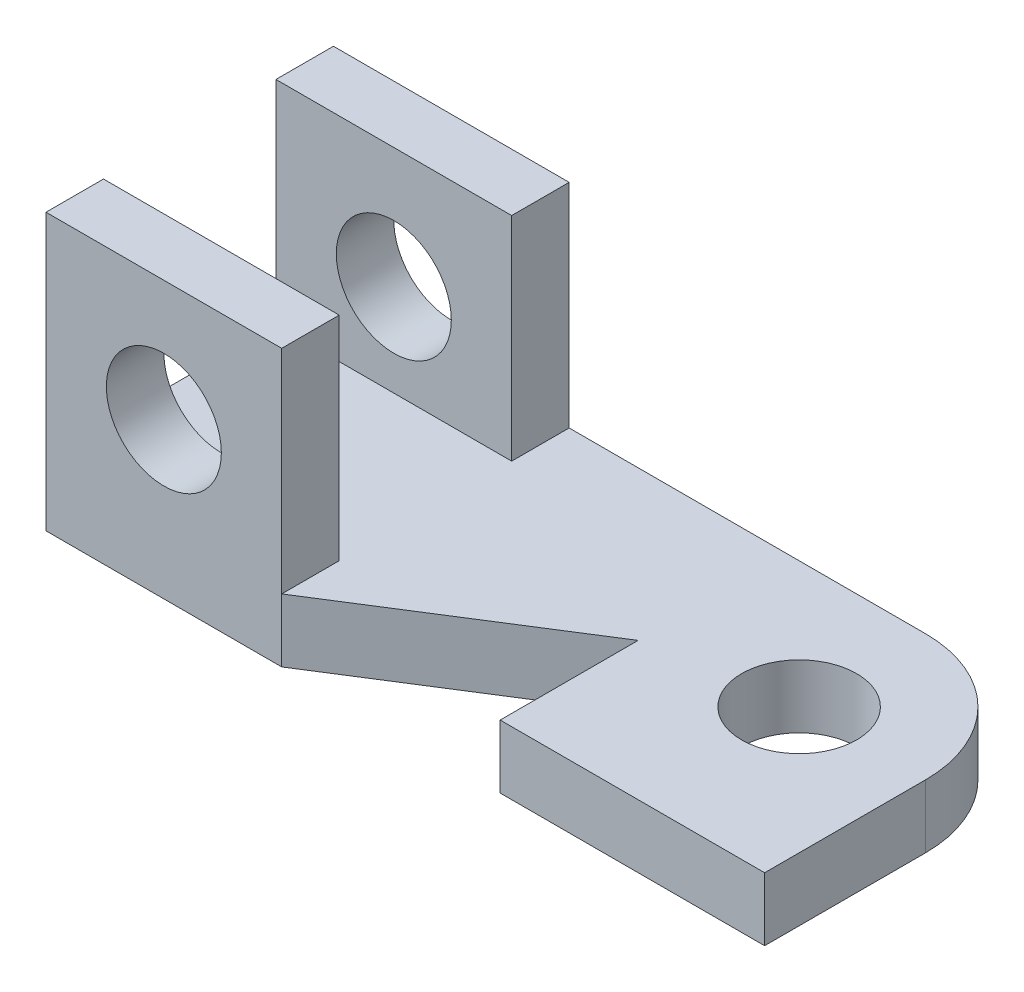
ISO-10303-21;
HEADER;
FILE_DESCRIPTION(('STEP AP214'),'2;1');
FILE_NAME('part.step','',(''),(''),'','','');
FILE_SCHEMA(('AUTOMOTIVE_DESIGN { 1 0 10303 214 1 1 1 1 }'));
ENDSEC;
DATA;
#1=APPLICATION_CONTEXT('core data for automotive mechanical design processes');
#2=APPLICATION_PROTOCOL_DEFINITION('international standard','automotive_design',2000,#1);
#3=PRODUCT_CONTEXT('',#1,'mechanical');
#4=PRODUCT('Part','Part','',(#3));
#5=PRODUCT_RELATED_PRODUCT_CATEGORY('part','',(#4));
#6=PRODUCT_DEFINITION_FORMATION('','',#4);
#7=PRODUCT_DEFINITION_CONTEXT('part definition',#1,'design');
#8=PRODUCT_DEFINITION('design','',#6,#7);
#9=PRODUCT_DEFINITION_SHAPE('','',#8);
#10=(LENGTH_UNIT() NAMED_UNIT(*) SI_UNIT(.MILLI.,.METRE.));
#11=(NAMED_UNIT(*) PLANE_ANGLE_UNIT() SI_UNIT($,.RADIAN.));
#12=(NAMED_UNIT(*) SI_UNIT($,.STERADIAN.) SOLID_ANGLE_UNIT());
#13=UNCERTAINTY_MEASURE_WITH_UNIT(LENGTH_MEASURE(1.E-05),#10,'distance_accuracy_value','');
#14=(GEOMETRIC_REPRESENTATION_CONTEXT(3) GLOBAL_UNCERTAINTY_ASSIGNED_CONTEXT((#13)) GLOBAL_UNIT_ASSIGNED_CONTEXT((#10,
#11,#12)) REPRESENTATION_CONTEXT('',''));
#15=CARTESIAN_POINT('',(0.,0.,0.));
#16=DIRECTION('',(0.,0.,1.));
#17=DIRECTION('',(1.,0.,0.));
#18=AXIS2_PLACEMENT_3D('',#15,#16,#17);
#19=CARTESIAN_POINT('',(0.,11.,0.));
#20=DIRECTION('',(0.,-1.,0.));
#21=DIRECTION('',(0.,0.,-1.));
#22=AXIS2_PLACEMENT_3D('',#19,#20,#21);
#23=PLANE('',#22);
#24=CARTESIAN_POINT('',(40.5,11.,-3.));
#25=DIRECTION('',(0.,1.,0.));
#26=DIRECTION('',(0.,0.,1.));
#27=AXIS2_PLACEMENT_3D('',#24,#25,#26);
#28=CIRCLE('',#27,10.);
#29=CARTESIAN_POINT('',(40.5,11.,7.));
#30=VERTEX_POINT('',#29);
#31=EDGE_CURVE('E203',#30,#30,#28,.T.);
#32=ORIENTED_EDGE('',*,*,#31,.F.);
#33=EDGE_LOOP('',(#32));
#34=FACE_BOUND('',#33,.T.);
#35=DIRECTION('',(0.,0.,-1.));
#36=VECTOR('',#35,1.);
#37=CARTESIAN_POINT('',(62.5,11.,25.));
#38=LINE('',#37,#36);
#39=CARTESIAN_POINT('',(62.5,11.,25.));
#40=VERTEX_POINT('',#39);
#41=CARTESIAN_POINT('',(62.5,11.,-3.));
#42=VERTEX_POINT('',#41);
#43=EDGE_CURVE('E210',#40,#42,#38,.T.);
#44=ORIENTED_EDGE('',*,*,#43,.T.);
#45=CARTESIAN_POINT('',(40.5,11.,-3.));
#46=DIRECTION('',(0.,-1.,0.));
#47=DIRECTION('',(0.,0.,-1.));
#48=AXIS2_PLACEMENT_3D('',#45,#46,#47);
#49=CIRCLE('',#48,22.);
#50=CARTESIAN_POINT('',(40.5,11.,-25.));
#51=VERTEX_POINT('',#50);
#52=EDGE_CURVE('E11',#42,#51,#49,.F.);
#53=ORIENTED_EDGE('',*,*,#52,.T.);
#54=DIRECTION('',(-1.,0.,0.));
#55=VECTOR('',#54,1.);
#56=CARTESIAN_POINT('',(-62.5,11.,-25.));
#57=LINE('',#56,#55);
#58=CARTESIAN_POINT('',(-21.5,11.,-25.));
#59=VERTEX_POINT('',#58);
#60=EDGE_CURVE('E212',#51,#59,#57,.T.);
#61=ORIENTED_EDGE('',*,*,#60,.T.);
#62=DIRECTION('',(0.,0.,-1.));
#63=VECTOR('',#62,1.);
#64=CARTESIAN_POINT('',(-21.5,11.,-25.));
#65=LINE('',#64,#63);
#66=CARTESIAN_POINT('',(-21.5,11.,-15.));
#67=VERTEX_POINT('',#66);
#68=EDGE_CURVE('E183',#67,#59,#65,.T.);
#69=ORIENTED_EDGE('',*,*,#68,.F.);
#70=DIRECTION('',(1.,0.,0.));
#71=VECTOR('',#70,1.);
#72=CARTESIAN_POINT('',(-62.5,11.,-15.));
#73=LINE('',#72,#71);
#74=CARTESIAN_POINT('',(-62.5,11.,-15.));
#75=VERTEX_POINT('',#74);
#76=EDGE_CURVE('E178',#75,#67,#73,.T.);
#77=ORIENTED_EDGE('',*,*,#76,.F.);
#78=DIRECTION('',(0.,0.,1.));
#79=VECTOR('',#78,1.);
#80=CARTESIAN_POINT('',(-62.5,11.,25.));
#81=LINE('',#80,#79);
#82=CARTESIAN_POINT('',(-62.5,11.,15.));
#83=VERTEX_POINT('',#82);
#84=EDGE_CURVE('E215',#75,#83,#81,.T.);
#85=ORIENTED_EDGE('',*,*,#84,.T.);
#86=DIRECTION('',(-1.,0.,0.));
#87=VECTOR('',#86,1.);
#88=CARTESIAN_POINT('',(-62.5,11.,15.));
#89=LINE('',#88,#87);
#90=CARTESIAN_POINT('',(-21.5,11.,15.));
#91=VERTEX_POINT('',#90);
#92=EDGE_CURVE('E159',#91,#83,#89,.T.);
#93=ORIENTED_EDGE('',*,*,#92,.F.);
#94=DIRECTION('',(0.,0.,-1.));
#95=VECTOR('',#94,1.);
#96=CARTESIAN_POINT('',(-21.5,11.,25.));
#97=LINE('',#96,#95);
#98=CARTESIAN_POINT('',(-21.5,11.,25.));
#99=VERTEX_POINT('',#98);
#100=EDGE_CURVE('E162',#99,#91,#97,.T.);
#101=ORIENTED_EDGE('',*,*,#100,.F.);
#102=DIRECTION('',(0.845488903030971,0.,-0.533992991387982));
#103=VECTOR('',#102,1.);
#104=CARTESIAN_POINT('',(16.5,11.,1.));
#105=LINE('',#104,#103);
#106=CARTESIAN_POINT('',(16.5,11.,1.));
#107=VERTEX_POINT('',#106);
#108=EDGE_CURVE('E217',#99,#107,#105,.T.);
#109=ORIENTED_EDGE('',*,*,#108,.T.);
#110=DIRECTION('',(0.,0.,1.));
#111=VECTOR('',#110,1.);
#112=CARTESIAN_POINT('',(16.5,11.,25.));
#113=LINE('',#112,#111);
#114=CARTESIAN_POINT('',(16.5,11.,25.));
#115=VERTEX_POINT('',#114);
#116=EDGE_CURVE('E219',#107,#115,#113,.T.);
#117=ORIENTED_EDGE('',*,*,#116,.T.);
#118=DIRECTION('',(1.,0.,0.));
#119=VECTOR('',#118,1.);
#120=CARTESIAN_POINT('',(16.5,11.,25.));
#121=LINE('',#120,#119);
#122=EDGE_CURVE('E221',#115,#40,#121,.T.);
#123=ORIENTED_EDGE('',*,*,#122,.T.);
#124=EDGE_LOOP('',(#44,#53,#61,#69,#77,#85,#93,#101,#109,#117,#123));
#125=FACE_BOUND('',#124,.T.);
#126=ADVANCED_FACE('F33',(#34,#125),#23,.F.);
#127=CARTESIAN_POINT('',(62.5,11.,25.));
#128=DIRECTION('',(-1.,0.,0.));
#129=DIRECTION('',(0.,0.,1.));
#130=AXIS2_PLACEMENT_3D('',#127,#128,#129);
#131=PLANE('',#130);
#132=DIRECTION('',(0.,0.,-1.));
#133=VECTOR('',#132,1.);
#134=CARTESIAN_POINT('',(62.5,0.,25.));
#135=LINE('',#134,#133);
#136=CARTESIAN_POINT('',(62.5,0.,25.));
#137=VERTEX_POINT('',#136);
#138=CARTESIAN_POINT('',(62.5,0.,-3.));
#139=VERTEX_POINT('',#138);
#140=EDGE_CURVE('E207',#137,#139,#135,.T.);
#141=ORIENTED_EDGE('',*,*,#140,.T.);
#142=DIRECTION('',(0.,-1.,0.));
#143=VECTOR('',#142,1.);
#144=CARTESIAN_POINT('',(62.5,11.,-3.));
#145=LINE('',#144,#143);
#146=EDGE_CURVE('E41',#139,#42,#145,.F.);
#147=ORIENTED_EDGE('',*,*,#146,.T.);
#148=ORIENTED_EDGE('',*,*,#43,.F.);
#149=DIRECTION('',(0.,-1.,0.));
#150=VECTOR('',#149,1.);
#151=CARTESIAN_POINT('',(62.5,11.,25.));
#152=LINE('',#151,#150);
#153=EDGE_CURVE('E223',#40,#137,#152,.T.);
#154=ORIENTED_EDGE('',*,*,#153,.T.);
#155=EDGE_LOOP('',(#141,#147,#148,#154));
#156=FACE_BOUND('',#155,.T.);
#157=ADVANCED_FACE('F296',(#156),#131,.F.);
#158=CARTESIAN_POINT('',(-62.5,11.,-25.));
#159=DIRECTION('',(0.,0.,1.));
#160=DIRECTION('',(1.,0.,0.));
#161=AXIS2_PLACEMENT_3D('',#158,#159,#160);
#162=PLANE('',#161);
#163=CARTESIAN_POINT('',(-42.,27.,-25.));
#164=DIRECTION('',(0.,0.,1.));
#165=DIRECTION('',(1.,0.,0.));
#166=AXIS2_PLACEMENT_3D('',#163,#164,#165);
#167=CIRCLE('',#166,10.);
#168=CARTESIAN_POINT('',(-32.,27.,-25.));
#169=VERTEX_POINT('',#168);
#170=EDGE_CURVE('E250',#169,#169,#167,.T.);
#171=ORIENTED_EDGE('',*,*,#170,.T.);
#172=EDGE_LOOP('',(#171));
#173=FACE_BOUND('',#172,.T.);
#174=ORIENTED_EDGE('',*,*,#60,.F.);
#175=DIRECTION('',(0.,-1.,0.));
#176=VECTOR('',#175,1.);
#177=CARTESIAN_POINT('',(40.5,11.,-25.));
#178=LINE('',#177,#176);
#179=CARTESIAN_POINT('',(40.5,0.,-25.));
#180=VERTEX_POINT('',#179);
#181=EDGE_CURVE('E246',#51,#180,#178,.T.);
#182=ORIENTED_EDGE('',*,*,#181,.T.);
#183=DIRECTION('',(-1.,0.,0.));
#184=VECTOR('',#183,1.);
#185=CARTESIAN_POINT('',(-62.5,0.,-25.));
#186=LINE('',#185,#184);
#187=CARTESIAN_POINT('',(-62.5,0.,-25.));
#188=VERTEX_POINT('',#187);
#189=EDGE_CURVE('E225',#180,#188,#186,.T.);
#190=ORIENTED_EDGE('',*,*,#189,.T.);
#191=DIRECTION('',(0.,-1.,0.));
#192=VECTOR('',#191,1.);
#193=CARTESIAN_POINT('',(-62.5,11.,-25.));
#194=LINE('',#193,#192);
#195=CARTESIAN_POINT('',(-62.5,48.,-25.));
#196=VERTEX_POINT('',#195);
#197=EDGE_CURVE('E142',#196,#188,#194,.T.);
#198=ORIENTED_EDGE('',*,*,#197,.F.);
#199=DIRECTION('',(-1.,0.,0.));
#200=VECTOR('',#199,1.);
#201=CARTESIAN_POINT('',(-62.5,48.,-25.));
#202=LINE('',#201,#200);
#203=CARTESIAN_POINT('',(-21.5,48.,-25.));
#204=VERTEX_POINT('',#203);
#205=EDGE_CURVE('E187',#204,#196,#202,.T.);
#206=ORIENTED_EDGE('',*,*,#205,.F.);
#207=DIRECTION('',(0.,-1.,0.));
#208=VECTOR('',#207,1.);
#209=CARTESIAN_POINT('',(-21.5,48.,-25.));
#210=LINE('',#209,#208);
#211=EDGE_CURVE('E190',#204,#59,#210,.T.);
#212=ORIENTED_EDGE('',*,*,#211,.T.);
#213=EDGE_LOOP('',(#174,#182,#190,#198,#206,#212));
#214=FACE_BOUND('',#213,.T.);
#215=ADVANCED_FACE('F256',(#173,#214),#162,.F.);
#216=CARTESIAN_POINT('',(-62.5,11.,25.));
#217=DIRECTION('',(1.,0.,0.));
#218=DIRECTION('',(0.,0.,-1.));
#219=AXIS2_PLACEMENT_3D('',#216,#217,#218);
#220=PLANE('',#219);
#221=DIRECTION('',(0.,0.,1.));
#222=VECTOR('',#221,1.);
#223=CARTESIAN_POINT('',(-62.5,0.,25.));
#224=LINE('',#223,#222);
#225=CARTESIAN_POINT('',(-62.5,0.,25.));
#226=VERTEX_POINT('',#225);
#227=EDGE_CURVE('E139',#188,#226,#224,.T.);
#228=ORIENTED_EDGE('',*,*,#227,.T.);
#229=DIRECTION('',(0.,-1.,0.));
#230=VECTOR('',#229,1.);
#231=CARTESIAN_POINT('',(-62.5,11.,25.));
#232=LINE('',#231,#230);
#233=CARTESIAN_POINT('',(-62.5,48.,25.));
#234=VERTEX_POINT('',#233);
#235=EDGE_CURVE('E131',#234,#226,#232,.T.);
#236=ORIENTED_EDGE('',*,*,#235,.F.);
#237=DIRECTION('',(0.,0.,1.));
#238=VECTOR('',#237,1.);
#239=CARTESIAN_POINT('',(-62.5,48.,25.));
#240=LINE('',#239,#238);
#241=CARTESIAN_POINT('',(-62.5,48.,15.));
#242=VERTEX_POINT('',#241);
#243=EDGE_CURVE('E136',#242,#234,#240,.T.);
#244=ORIENTED_EDGE('',*,*,#243,.F.);
#245=DIRECTION('',(0.,-1.,0.));
#246=VECTOR('',#245,1.);
#247=CARTESIAN_POINT('',(-62.5,48.,15.));
#248=LINE('',#247,#246);
#249=EDGE_CURVE('E170',#242,#83,#248,.T.);
#250=ORIENTED_EDGE('',*,*,#249,.T.);
#251=ORIENTED_EDGE('',*,*,#84,.F.);
#252=DIRECTION('',(0.,-1.,0.));
#253=VECTOR('',#252,1.);
#254=CARTESIAN_POINT('',(-62.5,48.,-15.));
#255=LINE('',#254,#253);
#256=CARTESIAN_POINT('',(-62.5,48.,-15.));
#257=VERTEX_POINT('',#256);
#258=EDGE_CURVE('E200',#257,#75,#255,.T.);
#259=ORIENTED_EDGE('',*,*,#258,.F.);
#260=DIRECTION('',(0.,0.,1.));
#261=VECTOR('',#260,1.);
#262=CARTESIAN_POINT('',(-62.5,48.,-25.));
#263=LINE('',#262,#261);
#264=EDGE_CURVE('E179',#196,#257,#263,.T.);
#265=ORIENTED_EDGE('',*,*,#264,.F.);
#266=ORIENTED_EDGE('',*,*,#197,.T.);
#267=EDGE_LOOP('',(#228,#236,#244,#250,#251,#259,#265,#266));
#268=FACE_BOUND('',#267,.T.);
#269=ADVANCED_FACE('F133',(#268),#220,.F.);
#270=CARTESIAN_POINT('',(-62.5,11.,25.));
#271=DIRECTION('',(0.,0.,-1.));
#272=DIRECTION('',(-1.,0.,0.));
#273=AXIS2_PLACEMENT_3D('',#270,#271,#272);
#274=PLANE('',#273);
#275=CARTESIAN_POINT('',(-42.,27.,25.));
#276=DIRECTION('',(0.,0.,1.));
#277=DIRECTION('',(1.,0.,0.));
#278=AXIS2_PLACEMENT_3D('',#275,#276,#277);
#279=CIRCLE('',#278,10.);
#280=CARTESIAN_POINT('',(-32.,27.,25.));
#281=VERTEX_POINT('',#280);
#282=EDGE_CURVE('E331',#281,#281,#279,.T.);
#283=ORIENTED_EDGE('',*,*,#282,.F.);
#284=EDGE_LOOP('',(#283));
#285=FACE_BOUND('',#284,.T.);
#286=DIRECTION('',(1.,0.,0.));
#287=VECTOR('',#286,1.);
#288=CARTESIAN_POINT('',(-62.5,0.,25.));
#289=LINE('',#288,#287);
#290=CARTESIAN_POINT('',(-21.5,0.,25.));
#291=VERTEX_POINT('',#290);
#292=EDGE_CURVE('E228',#226,#291,#289,.T.);
#293=ORIENTED_EDGE('',*,*,#292,.T.);
#294=DIRECTION('',(0.,-1.,0.));
#295=VECTOR('',#294,1.);
#296=CARTESIAN_POINT('',(-21.5,11.,25.));
#297=LINE('',#296,#295);
#298=EDGE_CURVE('E143',#99,#291,#297,.T.);
#299=ORIENTED_EDGE('',*,*,#298,.F.);
#300=DIRECTION('',(0.,-1.,0.));
#301=VECTOR('',#300,1.);
#302=CARTESIAN_POINT('',(-21.5,48.,25.));
#303=LINE('',#302,#301);
#304=CARTESIAN_POINT('',(-21.5,48.,25.));
#305=VERTEX_POINT('',#304);
#306=EDGE_CURVE('E150',#305,#99,#303,.T.);
#307=ORIENTED_EDGE('',*,*,#306,.F.);
#308=DIRECTION('',(1.,0.,0.));
#309=VECTOR('',#308,1.);
#310=CARTESIAN_POINT('',(-62.5,48.,25.));
#311=LINE('',#310,#309);
#312=EDGE_CURVE('E146',#234,#305,#311,.T.);
#313=ORIENTED_EDGE('',*,*,#312,.F.);
#314=ORIENTED_EDGE('',*,*,#235,.T.);
#315=EDGE_LOOP('',(#293,#299,#307,#313,#314));
#316=FACE_BOUND('',#315,.T.);
#317=ADVANCED_FACE('F147',(#285,#316),#274,.F.);
#318=CARTESIAN_POINT('',(16.5,11.,1.));
#319=DIRECTION('',(-0.533992991387982,0.,-0.845488903030971));
#320=DIRECTION('',(-0.845488903030971,0.,0.533992991387982));
#321=AXIS2_PLACEMENT_3D('',#318,#319,#320);
#322=PLANE('',#321);
#323=DIRECTION('',(0.845488903030971,0.,-0.533992991387982));
#324=VECTOR('',#323,1.);
#325=CARTESIAN_POINT('',(16.5,0.,1.));
#326=LINE('',#325,#324);
#327=CARTESIAN_POINT('',(16.5,0.,1.));
#328=VERTEX_POINT('',#327);
#329=EDGE_CURVE('E230',#291,#328,#326,.T.);
#330=ORIENTED_EDGE('',*,*,#329,.T.);
#331=DIRECTION('',(0.,-1.,0.));
#332=VECTOR('',#331,1.);
#333=CARTESIAN_POINT('',(16.5,11.,1.));
#334=LINE('',#333,#332);
#335=EDGE_CURVE('E240',#107,#328,#334,.T.);
#336=ORIENTED_EDGE('',*,*,#335,.F.);
#337=ORIENTED_EDGE('',*,*,#108,.F.);
#338=ORIENTED_EDGE('',*,*,#298,.T.);
#339=EDGE_LOOP('',(#330,#336,#337,#338));
#340=FACE_BOUND('',#339,.T.);
#341=ADVANCED_FACE('F264',(#340),#322,.F.);
#342=CARTESIAN_POINT('',(16.5,11.,25.));
#343=DIRECTION('',(1.,0.,0.));
#344=DIRECTION('',(0.,0.,-1.));
#345=AXIS2_PLACEMENT_3D('',#342,#343,#344);
#346=PLANE('',#345);
#347=DIRECTION('',(0.,0.,1.));
#348=VECTOR('',#347,1.);
#349=CARTESIAN_POINT('',(16.5,0.,25.));
#350=LINE('',#349,#348);
#351=CARTESIAN_POINT('',(16.5,0.,25.));
#352=VERTEX_POINT('',#351);
#353=EDGE_CURVE('E232',#328,#352,#350,.T.);
#354=ORIENTED_EDGE('',*,*,#353,.T.);
#355=DIRECTION('',(0.,-1.,0.));
#356=VECTOR('',#355,1.);
#357=CARTESIAN_POINT('',(16.5,11.,25.));
#358=LINE('',#357,#356);
#359=EDGE_CURVE('E237',#115,#352,#358,.T.);
#360=ORIENTED_EDGE('',*,*,#359,.F.);
#361=ORIENTED_EDGE('',*,*,#116,.F.);
#362=ORIENTED_EDGE('',*,*,#335,.T.);
#363=EDGE_LOOP('',(#354,#360,#361,#362));
#364=FACE_BOUND('',#363,.T.);
#365=ADVANCED_FACE('F313',(#364),#346,.F.);
#366=CARTESIAN_POINT('',(16.5,11.,25.));
#367=DIRECTION('',(0.,0.,-1.));
#368=DIRECTION('',(-1.,0.,0.));
#369=AXIS2_PLACEMENT_3D('',#366,#367,#368);
#370=PLANE('',#369);
#371=DIRECTION('',(1.,0.,0.));
#372=VECTOR('',#371,1.);
#373=CARTESIAN_POINT('',(16.5,0.,25.));
#374=LINE('',#373,#372);
#375=EDGE_CURVE('E213',#352,#137,#374,.T.);
#376=ORIENTED_EDGE('',*,*,#375,.T.);
#377=ORIENTED_EDGE('',*,*,#153,.F.);
#378=ORIENTED_EDGE('',*,*,#122,.F.);
#379=ORIENTED_EDGE('',*,*,#359,.T.);
#380=EDGE_LOOP('',(#376,#377,#378,#379));
#381=FACE_BOUND('',#380,.T.);
#382=ADVANCED_FACE('F309',(#381),#370,.F.);
#383=CARTESIAN_POINT('',(0.,0.,0.));
#384=DIRECTION('',(0.,-1.,0.));
#385=DIRECTION('',(0.,0.,-1.));
#386=AXIS2_PLACEMENT_3D('',#383,#384,#385);
#387=PLANE('',#386);
#388=CARTESIAN_POINT('',(40.5,0.,-3.));
#389=DIRECTION('',(0.,1.,0.));
#390=DIRECTION('',(0.,0.,1.));
#391=AXIS2_PLACEMENT_3D('',#388,#389,#390);
#392=CIRCLE('',#391,10.);
#393=CARTESIAN_POINT('',(40.5,0.,7.));
#394=VERTEX_POINT('',#393);
#395=EDGE_CURVE('E204',#394,#394,#392,.T.);
#396=ORIENTED_EDGE('',*,*,#395,.T.);
#397=EDGE_LOOP('',(#396));
#398=FACE_BOUND('',#397,.T.);
#399=ORIENTED_EDGE('',*,*,#189,.F.);
#400=CARTESIAN_POINT('',(40.5,0.,-3.));
#401=DIRECTION('',(0.,-1.,0.));
#402=DIRECTION('',(0.,0.,-1.));
#403=AXIS2_PLACEMENT_3D('',#400,#401,#402);
#404=CIRCLE('',#403,22.);
#405=EDGE_CURVE('E55',#180,#139,#404,.T.);
#406=ORIENTED_EDGE('',*,*,#405,.T.);
#407=ORIENTED_EDGE('',*,*,#140,.F.);
#408=ORIENTED_EDGE('',*,*,#375,.F.);
#409=ORIENTED_EDGE('',*,*,#353,.F.);
#410=ORIENTED_EDGE('',*,*,#329,.F.);
#411=ORIENTED_EDGE('',*,*,#292,.F.);
#412=ORIENTED_EDGE('',*,*,#227,.F.);
#413=EDGE_LOOP('',(#399,#406,#407,#408,#409,#410,#411,#412));
#414=FACE_BOUND('',#413,.T.);
#415=ADVANCED_FACE('F259',(#398,#414),#387,.T.);
#416=CARTESIAN_POINT('',(40.5,0.,-3.));
#417=DIRECTION('',(0.,1.,0.));
#418=DIRECTION('',(0.,0.,1.));
#419=AXIS2_PLACEMENT_3D('',#416,#417,#418);
#420=CYLINDRICAL_SURFACE('',#419,10.);
#421=ORIENTED_EDGE('',*,*,#395,.F.);
#422=EDGE_LOOP('',(#421));
#423=FACE_BOUND('',#422,.T.);
#424=ORIENTED_EDGE('',*,*,#31,.T.);
#425=EDGE_LOOP('',(#424));
#426=FACE_BOUND('',#425,.T.);
#427=ADVANCED_FACE('F305',(#423,#426),#420,.F.);
#428=CARTESIAN_POINT('',(-62.5,48.,-15.));
#429=DIRECTION('',(0.,0.,-1.));
#430=DIRECTION('',(-1.,0.,0.));
#431=AXIS2_PLACEMENT_3D('',#428,#429,#430);
#432=PLANE('',#431);
#433=CARTESIAN_POINT('',(-42.,27.,-15.));
#434=DIRECTION('',(0.,0.,-1.));
#435=DIRECTION('',(-1.,0.,0.));
#436=AXIS2_PLACEMENT_3D('',#433,#434,#435);
#437=CIRCLE('',#436,10.);
#438=CARTESIAN_POINT('',(-52.,27.,-15.));
#439=VERTEX_POINT('',#438);
#440=EDGE_CURVE('E165',#439,#439,#437,.T.);
#441=ORIENTED_EDGE('',*,*,#440,.T.);
#442=EDGE_LOOP('',(#441));
#443=FACE_BOUND('',#442,.T.);
#444=ORIENTED_EDGE('',*,*,#76,.T.);
#445=DIRECTION('',(0.,-1.,0.));
#446=VECTOR('',#445,1.);
#447=CARTESIAN_POINT('',(-21.5,48.,-15.));
#448=LINE('',#447,#446);
#449=CARTESIAN_POINT('',(-21.5,48.,-15.));
#450=VERTEX_POINT('',#449);
#451=EDGE_CURVE('E197',#450,#67,#448,.T.);
#452=ORIENTED_EDGE('',*,*,#451,.F.);
#453=DIRECTION('',(1.,0.,0.));
#454=VECTOR('',#453,1.);
#455=CARTESIAN_POINT('',(-62.5,48.,-15.));
#456=LINE('',#455,#454);
#457=EDGE_CURVE('E182',#257,#450,#456,.T.);
#458=ORIENTED_EDGE('',*,*,#457,.F.);
#459=ORIENTED_EDGE('',*,*,#258,.T.);
#460=EDGE_LOOP('',(#444,#452,#458,#459));
#461=FACE_BOUND('',#460,.T.);
#462=ADVANCED_FACE('F278',(#443,#461),#432,.F.);
#463=CARTESIAN_POINT('',(-21.5,48.,-25.));
#464=DIRECTION('',(-1.,0.,0.));
#465=DIRECTION('',(0.,0.,1.));
#466=AXIS2_PLACEMENT_3D('',#463,#464,#465);
#467=PLANE('',#466);
#468=ORIENTED_EDGE('',*,*,#68,.T.);
#469=ORIENTED_EDGE('',*,*,#211,.F.);
#470=DIRECTION('',(0.,0.,-1.));
#471=VECTOR('',#470,1.);
#472=CARTESIAN_POINT('',(-21.5,48.,-25.));
#473=LINE('',#472,#471);
#474=EDGE_CURVE('E185',#450,#204,#473,.T.);
#475=ORIENTED_EDGE('',*,*,#474,.F.);
#476=ORIENTED_EDGE('',*,*,#451,.T.);
#477=EDGE_LOOP('',(#468,#469,#475,#476));
#478=FACE_BOUND('',#477,.T.);
#479=ADVANCED_FACE('F286',(#478),#467,.F.);
#480=CARTESIAN_POINT('',(0.,48.,0.));
#481=DIRECTION('',(0.,1.,0.));
#482=DIRECTION('',(0.,0.,1.));
#483=AXIS2_PLACEMENT_3D('',#480,#481,#482);
#484=PLANE('',#483);
#485=ORIENTED_EDGE('',*,*,#264,.T.);
#486=ORIENTED_EDGE('',*,*,#457,.T.);
#487=ORIENTED_EDGE('',*,*,#474,.T.);
#488=ORIENTED_EDGE('',*,*,#205,.T.);
#489=EDGE_LOOP('',(#485,#486,#487,#488));
#490=FACE_BOUND('',#489,.T.);
#491=ADVANCED_FACE('F282',(#490),#484,.T.);
#492=CARTESIAN_POINT('',(-21.5,48.,25.));
#493=DIRECTION('',(-1.,0.,0.));
#494=DIRECTION('',(0.,0.,1.));
#495=AXIS2_PLACEMENT_3D('',#492,#493,#494);
#496=PLANE('',#495);
#497=ORIENTED_EDGE('',*,*,#100,.T.);
#498=DIRECTION('',(0.,-1.,0.));
#499=VECTOR('',#498,1.);
#500=CARTESIAN_POINT('',(-21.5,48.,15.));
#501=LINE('',#500,#499);
#502=CARTESIAN_POINT('',(-21.5,48.,15.));
#503=VERTEX_POINT('',#502);
#504=EDGE_CURVE('E174',#503,#91,#501,.T.);
#505=ORIENTED_EDGE('',*,*,#504,.F.);
#506=DIRECTION('',(0.,0.,-1.));
#507=VECTOR('',#506,1.);
#508=CARTESIAN_POINT('',(-21.5,48.,25.));
#509=LINE('',#508,#507);
#510=EDGE_CURVE('E153',#305,#503,#509,.T.);
#511=ORIENTED_EDGE('',*,*,#510,.F.);
#512=ORIENTED_EDGE('',*,*,#306,.T.);
#513=EDGE_LOOP('',(#497,#505,#511,#512));
#514=FACE_BOUND('',#513,.T.);
#515=ADVANCED_FACE('F271',(#514),#496,.F.);
#516=CARTESIAN_POINT('',(-62.5,48.,15.));
#517=DIRECTION('',(0.,0.,1.));
#518=DIRECTION('',(1.,0.,0.));
#519=AXIS2_PLACEMENT_3D('',#516,#517,#518);
#520=PLANE('',#519);
#521=CARTESIAN_POINT('',(-42.,27.,15.));
#522=DIRECTION('',(0.,0.,1.));
#523=DIRECTION('',(1.,0.,0.));
#524=AXIS2_PLACEMENT_3D('',#521,#522,#523);
#525=CIRCLE('',#524,10.);
#526=CARTESIAN_POINT('',(-32.,27.,15.));
#527=VERTEX_POINT('',#526);
#528=EDGE_CURVE('E247',#527,#527,#525,.T.);
#529=ORIENTED_EDGE('',*,*,#528,.T.);
#530=EDGE_LOOP('',(#529));
#531=FACE_BOUND('',#530,.T.);
#532=ORIENTED_EDGE('',*,*,#92,.T.);
#533=ORIENTED_EDGE('',*,*,#249,.F.);
#534=DIRECTION('',(-1.,0.,0.));
#535=VECTOR('',#534,1.);
#536=CARTESIAN_POINT('',(-62.5,48.,15.));
#537=LINE('',#536,#535);
#538=EDGE_CURVE('E157',#503,#242,#537,.T.);
#539=ORIENTED_EDGE('',*,*,#538,.F.);
#540=ORIENTED_EDGE('',*,*,#504,.T.);
#541=EDGE_LOOP('',(#532,#533,#539,#540));
#542=FACE_BOUND('',#541,.T.);
#543=ADVANCED_FACE('F273',(#531,#542),#520,.F.);
#544=CARTESIAN_POINT('',(0.,48.,0.));
#545=DIRECTION('',(0.,-1.,0.));
#546=DIRECTION('',(0.,0.,-1.));
#547=AXIS2_PLACEMENT_3D('',#544,#545,#546);
#548=PLANE('',#547);
#549=ORIENTED_EDGE('',*,*,#243,.T.);
#550=ORIENTED_EDGE('',*,*,#312,.T.);
#551=ORIENTED_EDGE('',*,*,#510,.T.);
#552=ORIENTED_EDGE('',*,*,#538,.T.);
#553=EDGE_LOOP('',(#549,#550,#551,#552));
#554=FACE_BOUND('',#553,.T.);
#555=ADVANCED_FACE('F155',(#554),#548,.F.);
#556=CARTESIAN_POINT('',(-42.,27.,-25.));
#557=DIRECTION('',(0.,0.,1.));
#558=DIRECTION('',(1.,0.,0.));
#559=AXIS2_PLACEMENT_3D('',#556,#557,#558);
#560=CYLINDRICAL_SURFACE('',#559,10.);
#561=ORIENTED_EDGE('',*,*,#282,.T.);
#562=EDGE_LOOP('',(#561));
#563=FACE_BOUND('',#562,.T.);
#564=ORIENTED_EDGE('',*,*,#528,.F.);
#565=EDGE_LOOP('',(#564));
#566=FACE_BOUND('',#565,.T.);
#567=ADVANCED_FACE('F292',(#563,#566),#560,.F.);
#568=ORIENTED_EDGE('',*,*,#170,.F.);
#569=EDGE_LOOP('',(#568));
#570=FACE_BOUND('',#569,.T.);
#571=ORIENTED_EDGE('',*,*,#440,.F.);
#572=EDGE_LOOP('',(#571));
#573=FACE_BOUND('',#572,.T.);
#574=ADVANCED_FACE('F288',(#570,#573),#560,.F.);
#575=CARTESIAN_POINT('',(40.5,11.,-3.));
#576=DIRECTION('',(0.,-1.,0.));
#577=DIRECTION('',(0.,0.,-1.));
#578=AXIS2_PLACEMENT_3D('',#575,#576,#577);
#579=CYLINDRICAL_SURFACE('',#578,22.);
#580=ORIENTED_EDGE('',*,*,#52,.F.);
#581=ORIENTED_EDGE('',*,*,#146,.F.);
#582=ORIENTED_EDGE('',*,*,#405,.F.);
#583=ORIENTED_EDGE('',*,*,#181,.F.);
#584=EDGE_LOOP('',(#580,#581,#582,#583));
#585=FACE_BOUND('',#584,.T.);
#586=ADVANCED_FACE('F35',(#585),#579,.T.);
#587=CLOSED_SHELL('',(#126,#157,#215,#269,#317,#341,#365,#382,#415,#427,#462,#479,#491,#515,
#543,#555,#567,#574,#586));
#588=MANIFOLD_SOLID_BREP('B2',#587);
#589=ADVANCED_BREP_SHAPE_REPRESENTATION('',(#18,#588),#14);
#590=SHAPE_DEFINITION_REPRESENTATION(#9,#589);
ENDSEC;
END-ISO-10303-21;
